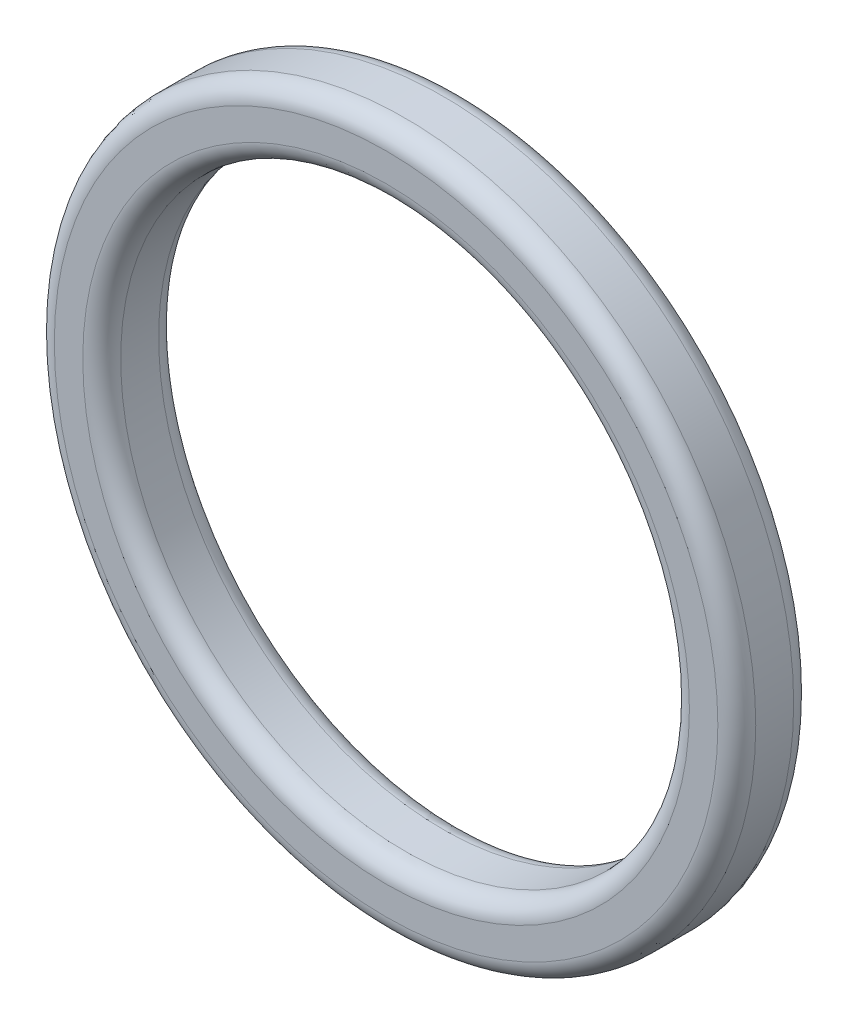
ISO-10303-21;
HEADER;
FILE_DESCRIPTION(('STEP AP214'),'2;1');
FILE_NAME('part.step','',(''),(''),'','','');
FILE_SCHEMA(('AUTOMOTIVE_DESIGN { 1 0 10303 214 1 1 1 1 }'));
ENDSEC;
DATA;
#1=APPLICATION_CONTEXT('core data for automotive mechanical design processes');
#2=APPLICATION_PROTOCOL_DEFINITION('international standard','automotive_design',2000,#1);
#3=PRODUCT_CONTEXT('',#1,'mechanical');
#4=PRODUCT('Part','Part','',(#3));
#5=PRODUCT_RELATED_PRODUCT_CATEGORY('part','',(#4));
#6=PRODUCT_DEFINITION_FORMATION('','',#4);
#7=PRODUCT_DEFINITION_CONTEXT('part definition',#1,'design');
#8=PRODUCT_DEFINITION('design','',#6,#7);
#9=PRODUCT_DEFINITION_SHAPE('','',#8);
#10=(LENGTH_UNIT() NAMED_UNIT(*) SI_UNIT(.MILLI.,.METRE.));
#11=(NAMED_UNIT(*) PLANE_ANGLE_UNIT() SI_UNIT($,.RADIAN.));
#12=(NAMED_UNIT(*) SI_UNIT($,.STERADIAN.) SOLID_ANGLE_UNIT());
#13=UNCERTAINTY_MEASURE_WITH_UNIT(LENGTH_MEASURE(1.E-05),#10,'distance_accuracy_value','');
#14=(GEOMETRIC_REPRESENTATION_CONTEXT(3) GLOBAL_UNCERTAINTY_ASSIGNED_CONTEXT((#13)) GLOBAL_UNIT_ASSIGNED_CONTEXT((#10,
#11,#12)) REPRESENTATION_CONTEXT('',''));
#15=CARTESIAN_POINT('',(0.,0.,0.));
#16=DIRECTION('',(0.,0.,1.));
#17=DIRECTION('',(1.,0.,0.));
#18=AXIS2_PLACEMENT_3D('',#15,#16,#17);
#19=CARTESIAN_POINT('',(0.,0.,4.));
#20=DIRECTION('',(0.,0.,1.));
#21=DIRECTION('',(1.,0.,0.));
#22=AXIS2_PLACEMENT_3D('',#19,#20,#21);
#23=PLANE('',#22);
#24=CARTESIAN_POINT('',(0.,0.,4.));
#25=DIRECTION('',(0.,0.,1.));
#26=DIRECTION('',(1.,0.,0.));
#27=AXIS2_PLACEMENT_3D('',#24,#25,#26);
#28=CIRCLE('',#27,16.);
#29=CARTESIAN_POINT('',(16.,0.,4.));
#30=VERTEX_POINT('',#29);
#31=EDGE_CURVE('E54',#30,#30,#28,.F.);
#32=ORIENTED_EDGE('',*,*,#31,.T.);
#33=EDGE_LOOP('',(#32));
#34=FACE_BOUND('',#33,.T.);
#35=CARTESIAN_POINT('',(0.,0.,4.));
#36=DIRECTION('',(0.,0.,1.));
#37=DIRECTION('',(1.,0.,0.));
#38=AXIS2_PLACEMENT_3D('',#35,#36,#37);
#39=CIRCLE('',#38,17.5);
#40=CARTESIAN_POINT('',(17.5,0.,4.));
#41=VERTEX_POINT('',#40);
#42=EDGE_CURVE('E57',#41,#41,#39,.T.);
#43=ORIENTED_EDGE('',*,*,#42,.T.);
#44=EDGE_LOOP('',(#43));
#45=FACE_BOUND('',#44,.T.);
#46=ADVANCED_FACE('F34',(#34,#45),#23,.T.);
#47=CARTESIAN_POINT('',(0.,0.,0.));
#48=DIRECTION('',(0.,0.,1.));
#49=DIRECTION('',(1.,0.,0.));
#50=AXIS2_PLACEMENT_3D('',#47,#48,#49);
#51=PLANE('',#50);
#52=CARTESIAN_POINT('',(0.,0.,0.));
#53=DIRECTION('',(0.,0.,1.));
#54=DIRECTION('',(1.,0.,0.));
#55=AXIS2_PLACEMENT_3D('',#52,#53,#54);
#56=CIRCLE('',#55,17.5);
#57=CARTESIAN_POINT('',(17.5,0.,0.));
#58=VERTEX_POINT('',#57);
#59=EDGE_CURVE('E10',#58,#58,#56,.F.);
#60=ORIENTED_EDGE('',*,*,#59,.T.);
#61=EDGE_LOOP('',(#60));
#62=FACE_BOUND('',#61,.T.);
#63=CARTESIAN_POINT('',(0.,0.,0.));
#64=DIRECTION('',(0.,0.,1.));
#65=DIRECTION('',(1.,0.,0.));
#66=AXIS2_PLACEMENT_3D('',#63,#64,#65);
#67=CIRCLE('',#66,16.);
#68=CARTESIAN_POINT('',(16.,0.,0.));
#69=VERTEX_POINT('',#68);
#70=EDGE_CURVE('E41',#69,#69,#67,.T.);
#71=ORIENTED_EDGE('',*,*,#70,.T.);
#72=EDGE_LOOP('',(#71));
#73=FACE_BOUND('',#72,.T.);
#74=ADVANCED_FACE('F78',(#62,#73),#51,.F.);
#75=CARTESIAN_POINT('',(0.,0.,4.));
#76=DIRECTION('',(0.,0.,-1.));
#77=DIRECTION('',(-1.,0.,0.));
#78=AXIS2_PLACEMENT_3D('',#75,#76,#77);
#79=CYLINDRICAL_SURFACE('',#78,18.5);
#80=CARTESIAN_POINT('',(0.,0.,1.));
#81=DIRECTION('',(0.,0.,1.));
#82=DIRECTION('',(1.,0.,0.));
#83=AXIS2_PLACEMENT_3D('',#80,#81,#82);
#84=CIRCLE('',#83,18.5);
#85=CARTESIAN_POINT('',(18.5,0.,1.));
#86=VERTEX_POINT('',#85);
#87=EDGE_CURVE('E45',#86,#86,#84,.T.);
#88=ORIENTED_EDGE('',*,*,#87,.T.);
#89=EDGE_LOOP('',(#88));
#90=FACE_BOUND('',#89,.T.);
#91=CARTESIAN_POINT('',(0.,0.,3.));
#92=DIRECTION('',(0.,0.,1.));
#93=DIRECTION('',(1.,0.,0.));
#94=AXIS2_PLACEMENT_3D('',#91,#92,#93);
#95=CIRCLE('',#94,18.5);
#96=CARTESIAN_POINT('',(18.5,0.,3.));
#97=VERTEX_POINT('',#96);
#98=EDGE_CURVE('E49',#97,#97,#95,.F.);
#99=ORIENTED_EDGE('',*,*,#98,.T.);
#100=EDGE_LOOP('',(#99));
#101=FACE_BOUND('',#100,.T.);
#102=ADVANCED_FACE('F84',(#90,#101),#79,.T.);
#103=CARTESIAN_POINT('',(0.,0.,4.));
#104=DIRECTION('',(0.,0.,-1.));
#105=DIRECTION('',(-1.,0.,0.));
#106=AXIS2_PLACEMENT_3D('',#103,#104,#105);
#107=CYLINDRICAL_SURFACE('',#106,15.);
#108=CARTESIAN_POINT('',(0.,0.,3.));
#109=DIRECTION('',(0.,0.,1.));
#110=DIRECTION('',(1.,0.,0.));
#111=AXIS2_PLACEMENT_3D('',#108,#109,#110);
#112=CIRCLE('',#111,15.);
#113=CARTESIAN_POINT('',(15.,0.,3.));
#114=VERTEX_POINT('',#113);
#115=EDGE_CURVE('E60',#114,#114,#112,.T.);
#116=ORIENTED_EDGE('',*,*,#115,.T.);
#117=EDGE_LOOP('',(#116));
#118=FACE_BOUND('',#117,.T.);
#119=CARTESIAN_POINT('',(0.,0.,1.));
#120=DIRECTION('',(0.,0.,1.));
#121=DIRECTION('',(1.,0.,0.));
#122=AXIS2_PLACEMENT_3D('',#119,#120,#121);
#123=CIRCLE('',#122,15.);
#124=CARTESIAN_POINT('',(15.,0.,1.));
#125=VERTEX_POINT('',#124);
#126=EDGE_CURVE('E63',#125,#125,#123,.F.);
#127=ORIENTED_EDGE('',*,*,#126,.T.);
#128=EDGE_LOOP('',(#127));
#129=FACE_BOUND('',#128,.T.);
#130=ADVANCED_FACE('F67',(#118,#129),#107,.F.);
#131=CARTESIAN_POINT('',(0.,0.,3.));
#132=DIRECTION('',(0.,0.,1.));
#133=DIRECTION('',(1.,0.,0.));
#134=AXIS2_PLACEMENT_3D('',#131,#132,#133);
#135=TOROIDAL_SURFACE('',#134,16.,1.);
#136=ORIENTED_EDGE('',*,*,#31,.F.);
#137=EDGE_LOOP('',(#136));
#138=FACE_BOUND('',#137,.T.);
#139=ORIENTED_EDGE('',*,*,#115,.F.);
#140=EDGE_LOOP('',(#139));
#141=FACE_BOUND('',#140,.T.);
#142=ADVANCED_FACE('F92',(#138,#141),#135,.T.);
#143=CARTESIAN_POINT('',(0.,0.,1.));
#144=DIRECTION('',(0.,0.,1.));
#145=DIRECTION('',(1.,0.,0.));
#146=AXIS2_PLACEMENT_3D('',#143,#144,#145);
#147=TOROIDAL_SURFACE('',#146,17.5,1.);
#148=ORIENTED_EDGE('',*,*,#59,.F.);
#149=EDGE_LOOP('',(#148));
#150=FACE_BOUND('',#149,.T.);
#151=ORIENTED_EDGE('',*,*,#87,.F.);
#152=EDGE_LOOP('',(#151));
#153=FACE_BOUND('',#152,.T.);
#154=ADVANCED_FACE('F75',(#150,#153),#147,.T.);
#155=CARTESIAN_POINT('',(0.,0.,3.));
#156=DIRECTION('',(0.,0.,1.));
#157=DIRECTION('',(1.,0.,0.));
#158=AXIS2_PLACEMENT_3D('',#155,#156,#157);
#159=TOROIDAL_SURFACE('',#158,17.5,1.);
#160=ORIENTED_EDGE('',*,*,#98,.F.);
#161=EDGE_LOOP('',(#160));
#162=FACE_BOUND('',#161,.T.);
#163=ORIENTED_EDGE('',*,*,#42,.F.);
#164=EDGE_LOOP('',(#163));
#165=FACE_BOUND('',#164,.T.);
#166=ADVANCED_FACE('F71',(#162,#165),#159,.T.);
#167=CARTESIAN_POINT('',(0.,0.,1.));
#168=DIRECTION('',(0.,0.,1.));
#169=DIRECTION('',(1.,0.,0.));
#170=AXIS2_PLACEMENT_3D('',#167,#168,#169);
#171=TOROIDAL_SURFACE('',#170,16.,1.);
#172=ORIENTED_EDGE('',*,*,#126,.F.);
#173=EDGE_LOOP('',(#172));
#174=FACE_BOUND('',#173,.T.);
#175=ORIENTED_EDGE('',*,*,#70,.F.);
#176=EDGE_LOOP('',(#175));
#177=FACE_BOUND('',#176,.T.);
#178=ADVANCED_FACE('F36',(#174,#177),#171,.T.);
#179=CLOSED_SHELL('',(#46,#74,#102,#130,#142,#154,#166,#178));
#180=MANIFOLD_SOLID_BREP('B2',#179);
#181=ADVANCED_BREP_SHAPE_REPRESENTATION('',(#18,#180),#14);
#182=SHAPE_DEFINITION_REPRESENTATION(#9,#181);
ENDSEC;
END-ISO-10303-21;
